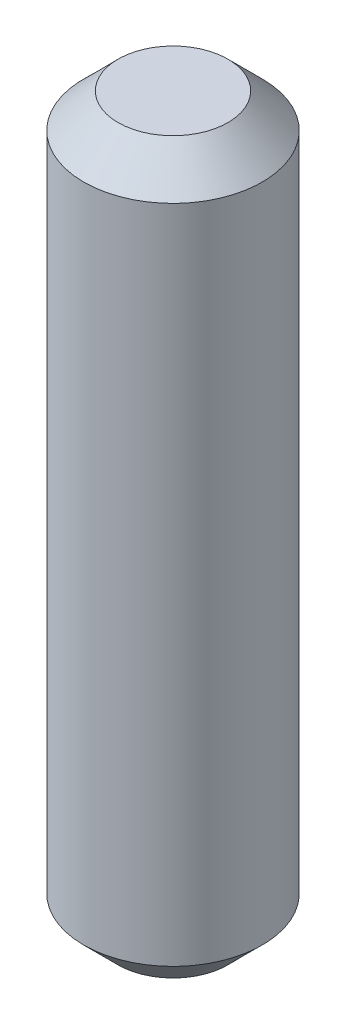
ISO-10303-21;
HEADER;
FILE_DESCRIPTION(('STEP AP214'),'2;1');
FILE_NAME('part.step','',(''),(''),'','','');
FILE_SCHEMA(('AUTOMOTIVE_DESIGN { 1 0 10303 214 1 1 1 1 }'));
ENDSEC;
DATA;
#1=APPLICATION_CONTEXT('core data for automotive mechanical design processes');
#2=APPLICATION_PROTOCOL_DEFINITION('international standard','automotive_design',2000,#1);
#3=PRODUCT_CONTEXT('',#1,'mechanical');
#4=PRODUCT('Part','Part','',(#3));
#5=PRODUCT_RELATED_PRODUCT_CATEGORY('part','',(#4));
#6=PRODUCT_DEFINITION_FORMATION('','',#4);
#7=PRODUCT_DEFINITION_CONTEXT('part definition',#1,'design');
#8=PRODUCT_DEFINITION('design','',#6,#7);
#9=PRODUCT_DEFINITION_SHAPE('','',#8);
#10=(LENGTH_UNIT() NAMED_UNIT(*) SI_UNIT(.MILLI.,.METRE.));
#11=(NAMED_UNIT(*) PLANE_ANGLE_UNIT() SI_UNIT($,.RADIAN.));
#12=(NAMED_UNIT(*) SI_UNIT($,.STERADIAN.) SOLID_ANGLE_UNIT());
#13=UNCERTAINTY_MEASURE_WITH_UNIT(LENGTH_MEASURE(1.E-05),#10,'distance_accuracy_value','');
#14=(GEOMETRIC_REPRESENTATION_CONTEXT(3) GLOBAL_UNCERTAINTY_ASSIGNED_CONTEXT((#13)) GLOBAL_UNIT_ASSIGNED_CONTEXT((#10,
#11,#12)) REPRESENTATION_CONTEXT('',''));
#15=CARTESIAN_POINT('',(0.,0.,0.));
#16=DIRECTION('',(0.,0.,1.));
#17=DIRECTION('',(1.,0.,0.));
#18=AXIS2_PLACEMENT_3D('',#15,#16,#17);
#19=CARTESIAN_POINT('',(0.,13.4874,0.));
#20=DIRECTION('',(0.,-1.,0.));
#21=DIRECTION('',(0.,0.,-1.));
#22=AXIS2_PLACEMENT_3D('',#19,#20,#21);
#23=CYLINDRICAL_SURFACE('',#22,1.651);
#24=CARTESIAN_POINT('',(0.,0.635,0.));
#25=DIRECTION('',(0.,1.,0.));
#26=DIRECTION('',(0.,0.,1.));
#27=AXIS2_PLACEMENT_3D('',#24,#25,#26);
#28=CIRCLE('',#27,1.651);
#29=CARTESIAN_POINT('',(0.,0.635,1.651));
#30=VERTEX_POINT('',#29);
#31=EDGE_CURVE('E59',#30,#30,#28,.T.);
#32=ORIENTED_EDGE('',*,*,#31,.T.);
#33=EDGE_LOOP('',(#32));
#34=FACE_BOUND('',#33,.T.);
#35=CARTESIAN_POINT('',(0.,12.8524,0.));
#36=DIRECTION('',(0.,1.,0.));
#37=DIRECTION('',(0.,0.,1.));
#38=AXIS2_PLACEMENT_3D('',#35,#36,#37);
#39=CIRCLE('',#38,1.651);
#40=CARTESIAN_POINT('',(0.,12.8524,1.651));
#41=VERTEX_POINT('',#40);
#42=EDGE_CURVE('E64',#41,#41,#39,.F.);
#43=ORIENTED_EDGE('',*,*,#42,.T.);
#44=EDGE_LOOP('',(#43));
#45=FACE_BOUND('',#44,.T.);
#46=ADVANCED_FACE('F45',(#34,#45),#23,.T.);
#47=CARTESIAN_POINT('',(0.,13.4874,0.));
#48=DIRECTION('',(0.,1.,0.));
#49=DIRECTION('',(0.,0.,1.));
#50=AXIS2_PLACEMENT_3D('',#47,#48,#49);
#51=PLANE('',#50);
#52=CARTESIAN_POINT('',(0.,13.4874,0.));
#53=DIRECTION('',(0.,1.,0.));
#54=DIRECTION('',(0.,0.,1.));
#55=AXIS2_PLACEMENT_3D('',#52,#53,#54);
#56=CIRCLE('',#55,1.016);
#57=CARTESIAN_POINT('',(0.,13.4874,1.016));
#58=VERTEX_POINT('',#57);
#59=EDGE_CURVE('E10',#58,#58,#56,.T.);
#60=ORIENTED_EDGE('',*,*,#59,.T.);
#61=EDGE_LOOP('',(#60));
#62=FACE_BOUND('',#61,.T.);
#63=ADVANCED_FACE('F81',(#62),#51,.T.);
#64=CARTESIAN_POINT('',(0.,0.,0.));
#65=DIRECTION('',(0.,1.,0.));
#66=DIRECTION('',(0.,0.,1.));
#67=AXIS2_PLACEMENT_3D('',#64,#65,#66);
#68=PLANE('',#67);
#69=CARTESIAN_POINT('',(0.,0.,0.));
#70=DIRECTION('',(0.,1.,0.));
#71=DIRECTION('',(0.,0.,1.));
#72=AXIS2_PLACEMENT_3D('',#69,#70,#71);
#73=CIRCLE('',#72,1.016);
#74=CARTESIAN_POINT('',(0.,0.,1.016));
#75=VERTEX_POINT('',#74);
#76=EDGE_CURVE('E54',#75,#75,#73,.F.);
#77=ORIENTED_EDGE('',*,*,#76,.T.);
#78=EDGE_LOOP('',(#77));
#79=FACE_BOUND('',#78,.T.);
#80=ADVANCED_FACE('F78',(#79),#68,.F.);
#81=CARTESIAN_POINT('',(0.,0.635,0.));
#82=DIRECTION('',(0.,1.,0.));
#83=DIRECTION('',(0.,0.,1.));
#84=AXIS2_PLACEMENT_3D('',#81,#82,#83);
#85=CONICAL_SURFACE('',#84,1.651,0.78539816339745);
#86=ORIENTED_EDGE('',*,*,#76,.F.);
#87=EDGE_LOOP('',(#86));
#88=FACE_BOUND('',#87,.T.);
#89=ORIENTED_EDGE('',*,*,#31,.F.);
#90=EDGE_LOOP('',(#89));
#91=FACE_BOUND('',#90,.T.);
#92=ADVANCED_FACE('F74',(#88,#91),#85,.T.);
#93=CARTESIAN_POINT('',(0.,13.4874,0.));
#94=DIRECTION('',(0.,-1.,0.));
#95=DIRECTION('',(0.,0.,-1.));
#96=AXIS2_PLACEMENT_3D('',#93,#94,#95);
#97=CONICAL_SURFACE('',#96,1.016,0.785398163397447);
#98=ORIENTED_EDGE('',*,*,#42,.F.);
#99=EDGE_LOOP('',(#98));
#100=FACE_BOUND('',#99,.T.);
#101=ORIENTED_EDGE('',*,*,#59,.F.);
#102=EDGE_LOOP('',(#101));
#103=FACE_BOUND('',#102,.T.);
#104=ADVANCED_FACE('F48',(#100,#103),#97,.T.);
#105=CLOSED_SHELL('',(#46,#63,#80,#92,#104));
#106=MANIFOLD_SOLID_BREP('B2',#105);
#107=ADVANCED_BREP_SHAPE_REPRESENTATION('',(#18,#106),#14);
#108=SHAPE_DEFINITION_REPRESENTATION(#9,#107);
ENDSEC;
END-ISO-10303-21;
